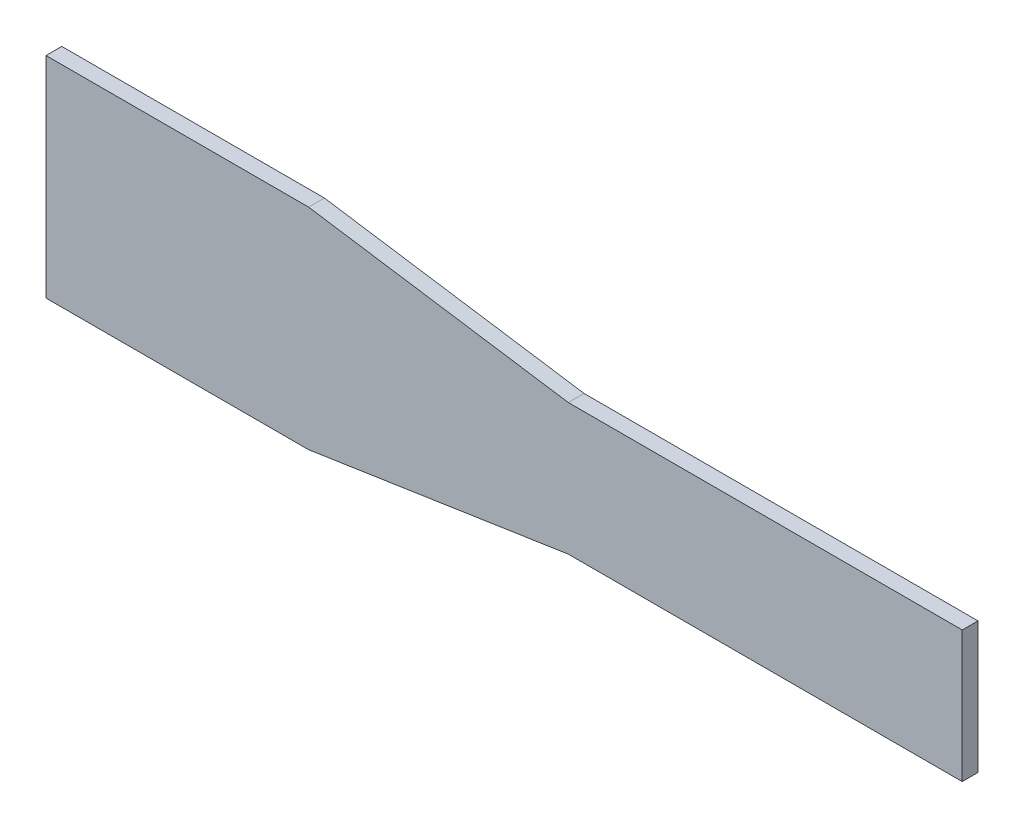
ISO-10303-21;
HEADER;
FILE_DESCRIPTION(('STEP AP214'),'2;1');
FILE_NAME('part.step','',(''),(''),'','','');
FILE_SCHEMA(('AUTOMOTIVE_DESIGN { 1 0 10303 214 1 1 1 1 }'));
ENDSEC;
DATA;
#1=APPLICATION_CONTEXT('core data for automotive mechanical design processes');
#2=APPLICATION_PROTOCOL_DEFINITION('international standard','automotive_design',2000,#1);
#3=PRODUCT_CONTEXT('',#1,'mechanical');
#4=PRODUCT('Part','Part','',(#3));
#5=PRODUCT_RELATED_PRODUCT_CATEGORY('part','',(#4));
#6=PRODUCT_DEFINITION_FORMATION('','',#4);
#7=PRODUCT_DEFINITION_CONTEXT('part definition',#1,'design');
#8=PRODUCT_DEFINITION('design','',#6,#7);
#9=PRODUCT_DEFINITION_SHAPE('','',#8);
#10=(LENGTH_UNIT() NAMED_UNIT(*) SI_UNIT(.MILLI.,.METRE.));
#11=(NAMED_UNIT(*) PLANE_ANGLE_UNIT() SI_UNIT($,.RADIAN.));
#12=(NAMED_UNIT(*) SI_UNIT($,.STERADIAN.) SOLID_ANGLE_UNIT());
#13=UNCERTAINTY_MEASURE_WITH_UNIT(LENGTH_MEASURE(1.E-05),#10,'distance_accuracy_value','');
#14=(GEOMETRIC_REPRESENTATION_CONTEXT(3) GLOBAL_UNCERTAINTY_ASSIGNED_CONTEXT((#13)) GLOBAL_UNIT_ASSIGNED_CONTEXT((#10,
#11,#12)) REPRESENTATION_CONTEXT('',''));
#15=CARTESIAN_POINT('',(0.,0.,0.));
#16=DIRECTION('',(0.,0.,1.));
#17=DIRECTION('',(1.,0.,0.));
#18=AXIS2_PLACEMENT_3D('',#15,#16,#17);
#19=CARTESIAN_POINT('',(0.,-12.5,3.));
#20=DIRECTION('',(0.,1.,0.));
#21=DIRECTION('',(-1.,0.,0.));
#22=AXIS2_PLACEMENT_3D('',#19,#20,#21);
#23=PLANE('',#22);
#24=DIRECTION('',(1.,0.,0.));
#25=VECTOR('',#24,1.);
#26=CARTESIAN_POINT('',(0.,-12.5,0.));
#27=LINE('',#26,#25);
#28=CARTESIAN_POINT('',(0.,-12.5,0.));
#29=VERTEX_POINT('',#28);
#30=CARTESIAN_POINT('',(75.,-12.5,0.));
#31=VERTEX_POINT('',#30);
#32=EDGE_CURVE('E129',#29,#31,#27,.T.);
#33=ORIENTED_EDGE('',*,*,#32,.T.);
#34=DIRECTION('',(0.,0.,-1.));
#35=VECTOR('',#34,1.);
#36=CARTESIAN_POINT('',(75.,-12.5,3.));
#37=LINE('',#36,#35);
#38=CARTESIAN_POINT('',(75.,-12.5,3.));
#39=VERTEX_POINT('',#38);
#40=EDGE_CURVE('E11',#39,#31,#37,.T.);
#41=ORIENTED_EDGE('',*,*,#40,.F.);
#42=DIRECTION('',(1.,0.,0.));
#43=VECTOR('',#42,1.);
#44=CARTESIAN_POINT('',(0.,-12.5,3.));
#45=LINE('',#44,#43);
#46=CARTESIAN_POINT('',(0.,-12.5,3.));
#47=VERTEX_POINT('',#46);
#48=EDGE_CURVE('E143',#47,#39,#45,.T.);
#49=ORIENTED_EDGE('',*,*,#48,.F.);
#50=DIRECTION('',(0.,0.,-1.));
#51=VECTOR('',#50,1.);
#52=CARTESIAN_POINT('',(0.,-12.5,3.));
#53=LINE('',#52,#51);
#54=EDGE_CURVE('E125',#47,#29,#53,.T.);
#55=ORIENTED_EDGE('',*,*,#54,.T.);
#56=EDGE_LOOP('',(#33,#41,#49,#55));
#57=FACE_BOUND('',#56,.T.);
#58=ADVANCED_FACE('F33',(#57),#23,.F.);
#59=CARTESIAN_POINT('',(75.,12.5,3.));
#60=DIRECTION('',(-1.,0.,0.));
#61=DIRECTION('',(0.,0.,1.));
#62=AXIS2_PLACEMENT_3D('',#59,#60,#61);
#63=PLANE('',#62);
#64=DIRECTION('',(0.,1.,0.));
#65=VECTOR('',#64,1.);
#66=CARTESIAN_POINT('',(75.,12.5,0.));
#67=LINE('',#66,#65);
#68=CARTESIAN_POINT('',(75.,12.5,0.));
#69=VERTEX_POINT('',#68);
#70=EDGE_CURVE('E132',#31,#69,#67,.T.);
#71=ORIENTED_EDGE('',*,*,#70,.T.);
#72=DIRECTION('',(0.,0.,-1.));
#73=VECTOR('',#72,1.);
#74=CARTESIAN_POINT('',(75.,12.5,3.));
#75=LINE('',#74,#73);
#76=CARTESIAN_POINT('',(75.,12.5,3.));
#77=VERTEX_POINT('',#76);
#78=EDGE_CURVE('E41',#77,#69,#75,.T.);
#79=ORIENTED_EDGE('',*,*,#78,.F.);
#80=DIRECTION('',(0.,1.,0.));
#81=VECTOR('',#80,1.);
#82=CARTESIAN_POINT('',(75.,12.5,3.));
#83=LINE('',#82,#81);
#84=EDGE_CURVE('E92',#39,#77,#83,.T.);
#85=ORIENTED_EDGE('',*,*,#84,.F.);
#86=ORIENTED_EDGE('',*,*,#40,.T.);
#87=EDGE_LOOP('',(#71,#79,#85,#86));
#88=FACE_BOUND('',#87,.T.);
#89=ADVANCED_FACE('F178',(#88),#63,.F.);
#90=CARTESIAN_POINT('',(0.,12.5,3.));
#91=DIRECTION('',(0.,-1.,0.));
#92=DIRECTION('',(1.,0.,0.));
#93=AXIS2_PLACEMENT_3D('',#90,#91,#92);
#94=PLANE('',#93);
#95=DIRECTION('',(-1.,0.,0.));
#96=VECTOR('',#95,1.);
#97=CARTESIAN_POINT('',(0.,12.5,0.));
#98=LINE('',#97,#96);
#99=CARTESIAN_POINT('',(0.,12.5,0.));
#100=VERTEX_POINT('',#99);
#101=EDGE_CURVE('E134',#69,#100,#98,.T.);
#102=ORIENTED_EDGE('',*,*,#101,.T.);
#103=DIRECTION('',(0.,0.,-1.));
#104=VECTOR('',#103,1.);
#105=CARTESIAN_POINT('',(0.,12.5,3.));
#106=LINE('',#105,#104);
#107=CARTESIAN_POINT('',(0.,12.5,3.));
#108=VERTEX_POINT('',#107);
#109=EDGE_CURVE('E150',#108,#100,#106,.T.);
#110=ORIENTED_EDGE('',*,*,#109,.F.);
#111=DIRECTION('',(-1.,0.,0.));
#112=VECTOR('',#111,1.);
#113=CARTESIAN_POINT('',(0.,12.5,3.));
#114=LINE('',#113,#112);
#115=EDGE_CURVE('E158',#77,#108,#114,.T.);
#116=ORIENTED_EDGE('',*,*,#115,.F.);
#117=ORIENTED_EDGE('',*,*,#78,.T.);
#118=EDGE_LOOP('',(#102,#110,#116,#117));
#119=FACE_BOUND('',#118,.T.);
#120=ADVANCED_FACE('F156',(#119),#94,.F.);
#121=CARTESIAN_POINT('',(0.,12.5,3.));
#122=DIRECTION('',(-0.15,-0.988685996664259,0.));
#123=DIRECTION('',(0.988685996664259,-0.15,0.));
#124=AXIS2_PLACEMENT_3D('',#121,#122,#123);
#125=PLANE('',#124);
#126=DIRECTION('',(-0.988685996664259,0.15,0.));
#127=VECTOR('',#126,1.);
#128=CARTESIAN_POINT('',(0.,12.5,0.));
#129=LINE('',#128,#127);
#130=CARTESIAN_POINT('',(-49.434299833213,20.,0.));
#131=VERTEX_POINT('',#130);
#132=EDGE_CURVE('E136',#100,#131,#129,.T.);
#133=ORIENTED_EDGE('',*,*,#132,.T.);
#134=DIRECTION('',(0.,0.,-1.));
#135=VECTOR('',#134,1.);
#136=CARTESIAN_POINT('',(-49.434299833213,20.,3.));
#137=LINE('',#136,#135);
#138=CARTESIAN_POINT('',(-49.434299833213,20.,3.));
#139=VERTEX_POINT('',#138);
#140=EDGE_CURVE('E147',#139,#131,#137,.T.);
#141=ORIENTED_EDGE('',*,*,#140,.F.);
#142=DIRECTION('',(-0.988685996664259,0.15,0.));
#143=VECTOR('',#142,1.);
#144=CARTESIAN_POINT('',(0.,12.5,3.));
#145=LINE('',#144,#143);
#146=EDGE_CURVE('E170',#108,#139,#145,.T.);
#147=ORIENTED_EDGE('',*,*,#146,.F.);
#148=ORIENTED_EDGE('',*,*,#109,.T.);
#149=EDGE_LOOP('',(#133,#141,#147,#148));
#150=FACE_BOUND('',#149,.T.);
#151=ADVANCED_FACE('F166',(#150),#125,.F.);
#152=CARTESIAN_POINT('',(-49.434299833213,20.,3.));
#153=DIRECTION('',(0.,-1.,0.));
#154=DIRECTION('',(1.,0.,0.));
#155=AXIS2_PLACEMENT_3D('',#152,#153,#154);
#156=PLANE('',#155);
#157=DIRECTION('',(-1.,0.,0.));
#158=VECTOR('',#157,1.);
#159=CARTESIAN_POINT('',(-49.434299833213,20.,0.));
#160=LINE('',#159,#158);
#161=CARTESIAN_POINT('',(-99.434299833213,20.,0.));
#162=VERTEX_POINT('',#161);
#163=EDGE_CURVE('E138',#131,#162,#160,.T.);
#164=ORIENTED_EDGE('',*,*,#163,.T.);
#165=DIRECTION('',(0.,0.,-1.));
#166=VECTOR('',#165,1.);
#167=CARTESIAN_POINT('',(-99.434299833213,20.,3.));
#168=LINE('',#167,#166);
#169=CARTESIAN_POINT('',(-99.434299833213,20.,3.));
#170=VERTEX_POINT('',#169);
#171=EDGE_CURVE('E120',#170,#162,#168,.T.);
#172=ORIENTED_EDGE('',*,*,#171,.F.);
#173=DIRECTION('',(-1.,0.,0.));
#174=VECTOR('',#173,1.);
#175=CARTESIAN_POINT('',(-49.434299833213,20.,3.));
#176=LINE('',#175,#174);
#177=EDGE_CURVE('E111',#139,#170,#176,.T.);
#178=ORIENTED_EDGE('',*,*,#177,.F.);
#179=ORIENTED_EDGE('',*,*,#140,.T.);
#180=EDGE_LOOP('',(#164,#172,#178,#179));
#181=FACE_BOUND('',#180,.T.);
#182=ADVANCED_FACE('F169',(#181),#156,.F.);
#183=CARTESIAN_POINT('',(-99.434299833213,20.,3.));
#184=DIRECTION('',(1.,0.,0.));
#185=DIRECTION('',(0.,0.,-1.));
#186=AXIS2_PLACEMENT_3D('',#183,#184,#185);
#187=PLANE('',#186);
#188=DIRECTION('',(0.,-1.,0.));
#189=VECTOR('',#188,1.);
#190=CARTESIAN_POINT('',(-99.434299833213,20.,0.));
#191=LINE('',#190,#189);
#192=CARTESIAN_POINT('',(-99.434299833213,-20.,0.));
#193=VERTEX_POINT('',#192);
#194=EDGE_CURVE('E119',#162,#193,#191,.T.);
#195=ORIENTED_EDGE('',*,*,#194,.T.);
#196=DIRECTION('',(0.,0.,-1.));
#197=VECTOR('',#196,1.);
#198=CARTESIAN_POINT('',(-99.434299833213,-20.,3.));
#199=LINE('',#198,#197);
#200=CARTESIAN_POINT('',(-99.434299833213,-20.,3.));
#201=VERTEX_POINT('',#200);
#202=EDGE_CURVE('E116',#201,#193,#199,.T.);
#203=ORIENTED_EDGE('',*,*,#202,.F.);
#204=DIRECTION('',(0.,-1.,0.));
#205=VECTOR('',#204,1.);
#206=CARTESIAN_POINT('',(-99.434299833213,20.,3.));
#207=LINE('',#206,#205);
#208=EDGE_CURVE('E105',#170,#201,#207,.T.);
#209=ORIENTED_EDGE('',*,*,#208,.F.);
#210=ORIENTED_EDGE('',*,*,#171,.T.);
#211=EDGE_LOOP('',(#195,#203,#209,#210));
#212=FACE_BOUND('',#211,.T.);
#213=ADVANCED_FACE('F117',(#212),#187,.F.);
#214=CARTESIAN_POINT('',(-99.434299833213,-20.,3.));
#215=DIRECTION('',(0.,1.,0.));
#216=DIRECTION('',(-1.,0.,0.));
#217=AXIS2_PLACEMENT_3D('',#214,#215,#216);
#218=PLANE('',#217);
#219=DIRECTION('',(1.,0.,0.));
#220=VECTOR('',#219,1.);
#221=CARTESIAN_POINT('',(-99.434299833213,-20.,0.));
#222=LINE('',#221,#220);
#223=CARTESIAN_POINT('',(-49.434299833213,-20.,0.));
#224=VERTEX_POINT('',#223);
#225=EDGE_CURVE('E78',#193,#224,#222,.T.);
#226=ORIENTED_EDGE('',*,*,#225,.T.);
#227=DIRECTION('',(0.,0.,-1.));
#228=VECTOR('',#227,1.);
#229=CARTESIAN_POINT('',(-49.434299833213,-20.,3.));
#230=LINE('',#229,#228);
#231=CARTESIAN_POINT('',(-49.434299833213,-20.,3.));
#232=VERTEX_POINT('',#231);
#233=EDGE_CURVE('E121',#232,#224,#230,.T.);
#234=ORIENTED_EDGE('',*,*,#233,.F.);
#235=DIRECTION('',(1.,0.,0.));
#236=VECTOR('',#235,1.);
#237=CARTESIAN_POINT('',(-99.434299833213,-20.,3.));
#238=LINE('',#237,#236);
#239=EDGE_CURVE('E109',#201,#232,#238,.T.);
#240=ORIENTED_EDGE('',*,*,#239,.F.);
#241=ORIENTED_EDGE('',*,*,#202,.T.);
#242=EDGE_LOOP('',(#226,#234,#240,#241));
#243=FACE_BOUND('',#242,.T.);
#244=ADVANCED_FACE('F123',(#243),#218,.F.);
#245=CARTESIAN_POINT('',(-49.434299833213,-20.,3.));
#246=DIRECTION('',(-0.15,0.988685996664259,0.));
#247=DIRECTION('',(-0.988685996664259,-0.15,0.));
#248=AXIS2_PLACEMENT_3D('',#245,#246,#247);
#249=PLANE('',#248);
#250=DIRECTION('',(0.988685996664259,0.15,0.));
#251=VECTOR('',#250,1.);
#252=CARTESIAN_POINT('',(-49.434299833213,-20.,0.));
#253=LINE('',#252,#251);
#254=EDGE_CURVE('E84',#224,#29,#253,.T.);
#255=ORIENTED_EDGE('',*,*,#254,.T.);
#256=ORIENTED_EDGE('',*,*,#54,.F.);
#257=DIRECTION('',(0.988685996664259,0.15,0.));
#258=VECTOR('',#257,1.);
#259=CARTESIAN_POINT('',(-49.434299833213,-20.,3.));
#260=LINE('',#259,#258);
#261=EDGE_CURVE('E49',#232,#47,#260,.T.);
#262=ORIENTED_EDGE('',*,*,#261,.F.);
#263=ORIENTED_EDGE('',*,*,#233,.T.);
#264=EDGE_LOOP('',(#255,#256,#262,#263));
#265=FACE_BOUND('',#264,.T.);
#266=ADVANCED_FACE('F194',(#265),#249,.F.);
#267=CARTESIAN_POINT('',(0.,0.,3.));
#268=DIRECTION('',(0.,0.,-1.));
#269=DIRECTION('',(-1.,0.,0.));
#270=AXIS2_PLACEMENT_3D('',#267,#268,#269);
#271=PLANE('',#270);
#272=ORIENTED_EDGE('',*,*,#48,.T.);
#273=ORIENTED_EDGE('',*,*,#84,.T.);
#274=ORIENTED_EDGE('',*,*,#115,.T.);
#275=ORIENTED_EDGE('',*,*,#146,.T.);
#276=ORIENTED_EDGE('',*,*,#177,.T.);
#277=ORIENTED_EDGE('',*,*,#208,.T.);
#278=ORIENTED_EDGE('',*,*,#239,.T.);
#279=ORIENTED_EDGE('',*,*,#261,.T.);
#280=EDGE_LOOP('',(#272,#273,#274,#275,#276,#277,#278,#279));
#281=FACE_BOUND('',#280,.T.);
#282=ADVANCED_FACE('F107',(#281),#271,.F.);
#283=CARTESIAN_POINT('',(0.,0.,0.));
#284=DIRECTION('',(0.,0.,-1.));
#285=DIRECTION('',(-1.,0.,0.));
#286=AXIS2_PLACEMENT_3D('',#283,#284,#285);
#287=PLANE('',#286);
#288=ORIENTED_EDGE('',*,*,#32,.F.);
#289=ORIENTED_EDGE('',*,*,#254,.F.);
#290=ORIENTED_EDGE('',*,*,#225,.F.);
#291=ORIENTED_EDGE('',*,*,#194,.F.);
#292=ORIENTED_EDGE('',*,*,#163,.F.);
#293=ORIENTED_EDGE('',*,*,#132,.F.);
#294=ORIENTED_EDGE('',*,*,#101,.F.);
#295=ORIENTED_EDGE('',*,*,#70,.F.);
#296=EDGE_LOOP('',(#288,#289,#290,#291,#292,#293,#294,#295));
#297=FACE_BOUND('',#296,.T.);
#298=ADVANCED_FACE('F162',(#297),#287,.T.);
#299=CLOSED_SHELL('',(#58,#89,#120,#151,#182,#213,#244,#266,#282,#298));
#300=MANIFOLD_SOLID_BREP('B2',#299);
#301=ADVANCED_BREP_SHAPE_REPRESENTATION('',(#18,#300),#14);
#302=SHAPE_DEFINITION_REPRESENTATION(#9,#301);
ENDSEC;
END-ISO-10303-21;
